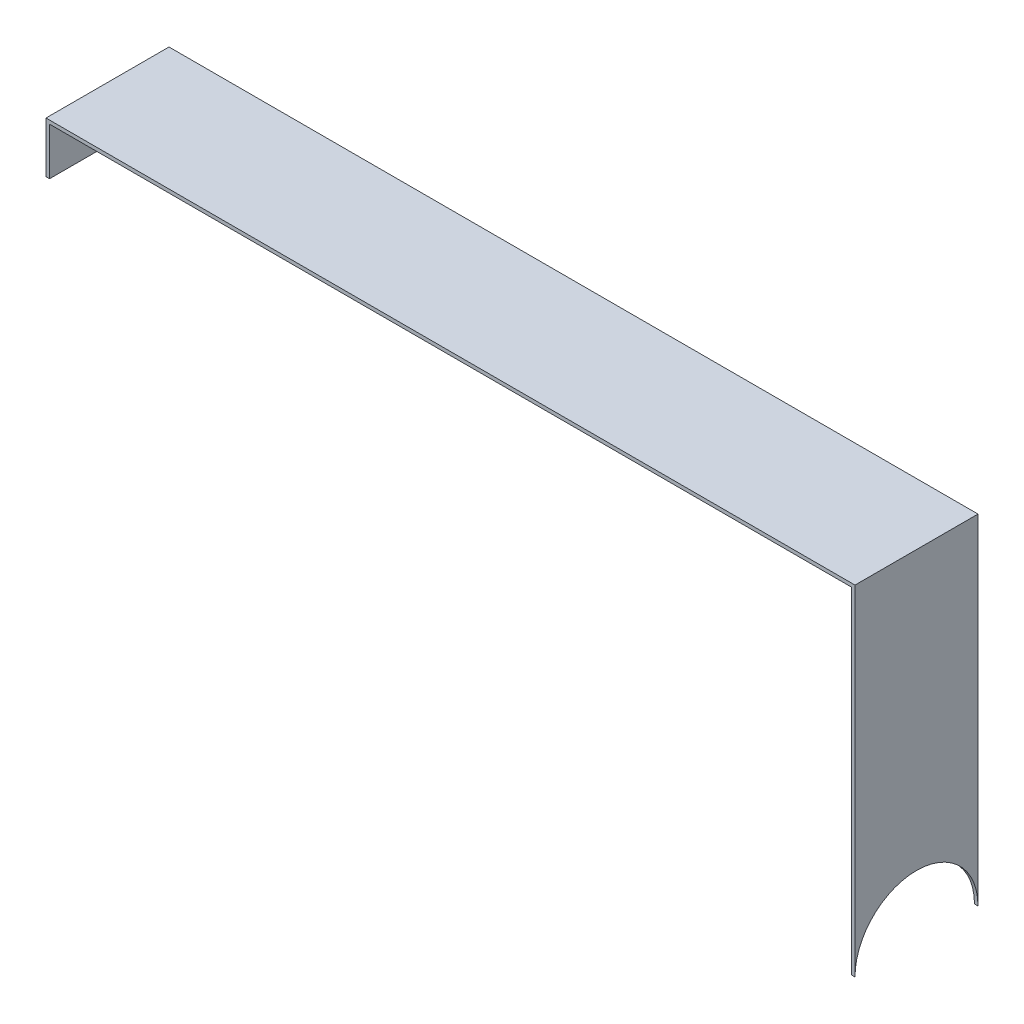
ISO-10303-21;
HEADER;
FILE_DESCRIPTION(('STEP AP214'),'2;1');
FILE_NAME('part.step','',(''),(''),'','','');
FILE_SCHEMA(('AUTOMOTIVE_DESIGN { 1 0 10303 214 1 1 1 1 }'));
ENDSEC;
DATA;
#1=APPLICATION_CONTEXT('core data for automotive mechanical design processes');
#2=APPLICATION_PROTOCOL_DEFINITION('international standard','automotive_design',2000,#1);
#3=PRODUCT_CONTEXT('',#1,'mechanical');
#4=PRODUCT('Part','Part','',(#3));
#5=PRODUCT_RELATED_PRODUCT_CATEGORY('part','',(#4));
#6=PRODUCT_DEFINITION_FORMATION('','',#4);
#7=PRODUCT_DEFINITION_CONTEXT('part definition',#1,'design');
#8=PRODUCT_DEFINITION('design','',#6,#7);
#9=PRODUCT_DEFINITION_SHAPE('','',#8);
#10=(LENGTH_UNIT() NAMED_UNIT(*) SI_UNIT(.MILLI.,.METRE.));
#11=(NAMED_UNIT(*) PLANE_ANGLE_UNIT() SI_UNIT($,.RADIAN.));
#12=(NAMED_UNIT(*) SI_UNIT($,.STERADIAN.) SOLID_ANGLE_UNIT());
#13=UNCERTAINTY_MEASURE_WITH_UNIT(LENGTH_MEASURE(1.E-05),#10,'distance_accuracy_value','');
#14=(GEOMETRIC_REPRESENTATION_CONTEXT(3) GLOBAL_UNCERTAINTY_ASSIGNED_CONTEXT((#13)) GLOBAL_UNIT_ASSIGNED_CONTEXT((#10,
#11,#12)) REPRESENTATION_CONTEXT('',''));
#15=CARTESIAN_POINT('',(0.,0.,0.));
#16=DIRECTION('',(0.,0.,1.));
#17=DIRECTION('',(1.,0.,0.));
#18=AXIS2_PLACEMENT_3D('',#15,#16,#17);
#19=CARTESIAN_POINT('',(206.15487364032,44.3470334548326,52.));
#20=DIRECTION('',(0.,1.,0.));
#21=DIRECTION('',(0.,0.,1.));
#22=AXIS2_PLACEMENT_3D('',#19,#20,#21);
#23=PLANE('',#22);
#24=DIRECTION('',(1.,0.,0.));
#25=VECTOR('',#24,1.);
#26=CARTESIAN_POINT('',(206.15487364032,44.3470334548326,0.));
#27=LINE('',#26,#25);
#28=CARTESIAN_POINT('',(-47.8451263596801,44.3470334548326,0.));
#29=VERTEX_POINT('',#28);
#30=CARTESIAN_POINT('',(291.15487364032,44.3470334548326,0.));
#31=VERTEX_POINT('',#30);
#32=EDGE_CURVE('E87',#29,#31,#27,.T.);
#33=ORIENTED_EDGE('',*,*,#32,.T.);
#34=DIRECTION('',(0.,0.,-1.));
#35=VECTOR('',#34,1.);
#36=CARTESIAN_POINT('',(291.15487364032,44.3470334548326,52.));
#37=LINE('',#36,#35);
#38=CARTESIAN_POINT('',(291.15487364032,44.3470334548326,52.));
#39=VERTEX_POINT('',#38);
#40=EDGE_CURVE('E11',#39,#31,#37,.T.);
#41=ORIENTED_EDGE('',*,*,#40,.F.);
#42=DIRECTION('',(1.,0.,0.));
#43=VECTOR('',#42,1.);
#44=CARTESIAN_POINT('',(-37.84512635968,44.3470334548326,52.));
#45=LINE('',#44,#43);
#46=CARTESIAN_POINT('',(-47.8451263596801,44.3470334548326,52.));
#47=VERTEX_POINT('',#46);
#48=EDGE_CURVE('E93',#47,#39,#45,.T.);
#49=ORIENTED_EDGE('',*,*,#48,.F.);
#50=DIRECTION('',(0.,0.,-1.));
#51=VECTOR('',#50,1.);
#52=CARTESIAN_POINT('',(-47.8451263596801,44.3470334548326,52.));
#53=LINE('',#52,#51);
#54=EDGE_CURVE('E124',#47,#29,#53,.T.);
#55=ORIENTED_EDGE('',*,*,#54,.T.);
#56=EDGE_LOOP('',(#33,#41,#49,#55));
#57=FACE_BOUND('',#56,.T.);
#58=ADVANCED_FACE('F37',(#57),#23,.F.);
#59=CARTESIAN_POINT('',(291.15487364032,44.3470334548326,52.));
#60=DIRECTION('',(1.,0.,0.));
#61=DIRECTION('',(0.,0.,-1.));
#62=AXIS2_PLACEMENT_3D('',#59,#60,#61);
#63=PLANE('',#62);
#64=DIRECTION('',(0.,-1.,0.));
#65=VECTOR('',#64,1.);
#66=CARTESIAN_POINT('',(291.15487364032,44.3470334548326,0.));
#67=LINE('',#66,#65);
#68=CARTESIAN_POINT('',(291.15487364032,-97.6529665451674,0.));
#69=VERTEX_POINT('',#68);
#70=EDGE_CURVE('E129',#31,#69,#67,.T.);
#71=ORIENTED_EDGE('',*,*,#70,.T.);
#72=CARTESIAN_POINT('',(291.15487364032,-97.6529665451674,26.));
#73=DIRECTION('',(-1.,0.,0.));
#74=DIRECTION('',(0.,0.,1.));
#75=AXIS2_PLACEMENT_3D('',#72,#73,#74);
#76=CIRCLE('',#75,26.);
#77=CARTESIAN_POINT('',(291.15487364032,-97.6529665451674,52.));
#78=VERTEX_POINT('',#77);
#79=EDGE_CURVE('E181',#78,#69,#76,.T.);
#80=ORIENTED_EDGE('',*,*,#79,.F.);
#81=DIRECTION('',(0.,-1.,0.));
#82=VECTOR('',#81,1.);
#83=CARTESIAN_POINT('',(291.15487364032,44.3470334548326,52.));
#84=LINE('',#83,#82);
#85=EDGE_CURVE('E162',#39,#78,#84,.T.);
#86=ORIENTED_EDGE('',*,*,#85,.F.);
#87=ORIENTED_EDGE('',*,*,#40,.T.);
#88=EDGE_LOOP('',(#71,#80,#86,#87));
#89=FACE_BOUND('',#88,.T.);
#90=ADVANCED_FACE('F183',(#89),#63,.F.);
#91=CARTESIAN_POINT('',(292.65487364032,-97.6529665451674,52.));
#92=DIRECTION('',(-1.,0.,0.));
#93=DIRECTION('',(0.,0.,1.));
#94=AXIS2_PLACEMENT_3D('',#91,#92,#93);
#95=PLANE('',#94);
#96=DIRECTION('',(0.,1.,0.));
#97=VECTOR('',#96,1.);
#98=CARTESIAN_POINT('',(292.65487364032,-97.6529665451674,52.));
#99=LINE('',#98,#97);
#100=CARTESIAN_POINT('',(292.65487364032,-97.6529665451674,52.));
#101=VERTEX_POINT('',#100);
#102=CARTESIAN_POINT('',(292.65487364032,45.8470334548325,52.));
#103=VERTEX_POINT('',#102);
#104=EDGE_CURVE('E171',#101,#103,#99,.T.);
#105=ORIENTED_EDGE('',*,*,#104,.F.);
#106=CARTESIAN_POINT('',(292.65487364032,-97.6529665451674,26.));
#107=DIRECTION('',(-1.,0.,0.));
#108=DIRECTION('',(0.,0.,1.));
#109=AXIS2_PLACEMENT_3D('',#106,#107,#108);
#110=CIRCLE('',#109,26.);
#111=CARTESIAN_POINT('',(292.65487364032,-97.6529665451674,0.));
#112=VERTEX_POINT('',#111);
#113=EDGE_CURVE('E130',#101,#112,#110,.T.);
#114=ORIENTED_EDGE('',*,*,#113,.T.);
#115=DIRECTION('',(0.,1.,0.));
#116=VECTOR('',#115,1.);
#117=CARTESIAN_POINT('',(292.65487364032,-97.6529665451674,0.));
#118=LINE('',#117,#116);
#119=CARTESIAN_POINT('',(292.65487364032,45.8470334548325,0.));
#120=VERTEX_POINT('',#119);
#121=EDGE_CURVE('E136',#112,#120,#118,.T.);
#122=ORIENTED_EDGE('',*,*,#121,.T.);
#123=DIRECTION('',(0.,0.,-1.));
#124=VECTOR('',#123,1.);
#125=CARTESIAN_POINT('',(292.65487364032,45.8470334548325,52.));
#126=LINE('',#125,#124);
#127=EDGE_CURVE('E45',#103,#120,#126,.T.);
#128=ORIENTED_EDGE('',*,*,#127,.F.);
#129=EDGE_LOOP('',(#105,#114,#122,#128));
#130=FACE_BOUND('',#129,.T.);
#131=ADVANCED_FACE('F174',(#130),#95,.F.);
#132=CARTESIAN_POINT('',(292.65487364032,45.8470334548325,52.));
#133=DIRECTION('',(0.,-1.,0.));
#134=DIRECTION('',(0.,0.,-1.));
#135=AXIS2_PLACEMENT_3D('',#132,#133,#134);
#136=PLANE('',#135);
#137=DIRECTION('',(-1.,0.,0.));
#138=VECTOR('',#137,1.);
#139=CARTESIAN_POINT('',(292.65487364032,45.8470334548325,0.));
#140=LINE('',#139,#138);
#141=CARTESIAN_POINT('',(-49.3451263596801,45.8470334548325,0.));
#142=VERTEX_POINT('',#141);
#143=EDGE_CURVE('E138',#120,#142,#140,.T.);
#144=ORIENTED_EDGE('',*,*,#143,.T.);
#145=DIRECTION('',(0.,0.,-1.));
#146=VECTOR('',#145,1.);
#147=CARTESIAN_POINT('',(-49.3451263596801,45.8470334548325,52.));
#148=LINE('',#147,#146);
#149=CARTESIAN_POINT('',(-49.3451263596801,45.8470334548325,52.));
#150=VERTEX_POINT('',#149);
#151=EDGE_CURVE('E119',#150,#142,#148,.T.);
#152=ORIENTED_EDGE('',*,*,#151,.F.);
#153=DIRECTION('',(-1.,0.,0.));
#154=VECTOR('',#153,1.);
#155=CARTESIAN_POINT('',(292.65487364032,45.8470334548325,52.));
#156=LINE('',#155,#154);
#157=EDGE_CURVE('E110',#103,#150,#156,.T.);
#158=ORIENTED_EDGE('',*,*,#157,.F.);
#159=ORIENTED_EDGE('',*,*,#127,.T.);
#160=EDGE_LOOP('',(#144,#152,#158,#159));
#161=FACE_BOUND('',#160,.T.);
#162=ADVANCED_FACE('F151',(#161),#136,.F.);
#163=CARTESIAN_POINT('',(-49.3451263596801,45.8470334548325,52.));
#164=DIRECTION('',(1.,0.,0.));
#165=DIRECTION('',(0.,0.,-1.));
#166=AXIS2_PLACEMENT_3D('',#163,#164,#165);
#167=PLANE('',#166);
#168=DIRECTION('',(0.,-1.,0.));
#169=VECTOR('',#168,1.);
#170=CARTESIAN_POINT('',(-49.3451263596801,45.8470334548325,0.));
#171=LINE('',#170,#169);
#172=CARTESIAN_POINT('',(-49.3451263596801,24.3470334548325,0.));
#173=VERTEX_POINT('',#172);
#174=EDGE_CURVE('E118',#142,#173,#171,.T.);
#175=ORIENTED_EDGE('',*,*,#174,.T.);
#176=DIRECTION('',(0.,0.,-1.));
#177=VECTOR('',#176,1.);
#178=CARTESIAN_POINT('',(-49.3451263596801,24.3470334548325,52.));
#179=LINE('',#178,#177);
#180=CARTESIAN_POINT('',(-49.3451263596801,24.3470334548325,52.));
#181=VERTEX_POINT('',#180);
#182=EDGE_CURVE('E115',#181,#173,#179,.T.);
#183=ORIENTED_EDGE('',*,*,#182,.F.);
#184=DIRECTION('',(0.,-1.,0.));
#185=VECTOR('',#184,1.);
#186=CARTESIAN_POINT('',(-49.3451263596801,45.8470334548325,52.));
#187=LINE('',#186,#185);
#188=EDGE_CURVE('E104',#150,#181,#187,.T.);
#189=ORIENTED_EDGE('',*,*,#188,.F.);
#190=ORIENTED_EDGE('',*,*,#151,.T.);
#191=EDGE_LOOP('',(#175,#183,#189,#190));
#192=FACE_BOUND('',#191,.T.);
#193=ADVANCED_FACE('F116',(#192),#167,.F.);
#194=CARTESIAN_POINT('',(-49.3451263596801,24.3470334548325,52.));
#195=DIRECTION('',(0.,1.,0.));
#196=DIRECTION('',(0.,0.,1.));
#197=AXIS2_PLACEMENT_3D('',#194,#195,#196);
#198=PLANE('',#197);
#199=DIRECTION('',(1.,0.,0.));
#200=VECTOR('',#199,1.);
#201=CARTESIAN_POINT('',(-49.3451263596801,24.3470334548325,0.));
#202=LINE('',#201,#200);
#203=CARTESIAN_POINT('',(-47.8451263596801,24.3470334548325,0.));
#204=VERTEX_POINT('',#203);
#205=EDGE_CURVE('E80',#173,#204,#202,.T.);
#206=ORIENTED_EDGE('',*,*,#205,.T.);
#207=DIRECTION('',(0.,0.,-1.));
#208=VECTOR('',#207,1.);
#209=CARTESIAN_POINT('',(-47.8451263596801,24.3470334548325,52.));
#210=LINE('',#209,#208);
#211=CARTESIAN_POINT('',(-47.8451263596801,24.3470334548325,52.));
#212=VERTEX_POINT('',#211);
#213=EDGE_CURVE('E120',#212,#204,#210,.T.);
#214=ORIENTED_EDGE('',*,*,#213,.F.);
#215=DIRECTION('',(1.,0.,0.));
#216=VECTOR('',#215,1.);
#217=CARTESIAN_POINT('',(-49.3451263596801,24.3470334548325,52.));
#218=LINE('',#217,#216);
#219=EDGE_CURVE('E108',#181,#212,#218,.T.);
#220=ORIENTED_EDGE('',*,*,#219,.F.);
#221=ORIENTED_EDGE('',*,*,#182,.T.);
#222=EDGE_LOOP('',(#206,#214,#220,#221));
#223=FACE_BOUND('',#222,.T.);
#224=ADVANCED_FACE('F122',(#223),#198,.F.);
#225=CARTESIAN_POINT('',(-47.8451263596801,44.3470334548326,52.));
#226=DIRECTION('',(-1.,0.,0.));
#227=DIRECTION('',(0.,0.,1.));
#228=AXIS2_PLACEMENT_3D('',#225,#226,#227);
#229=PLANE('',#228);
#230=DIRECTION('',(0.,1.,0.));
#231=VECTOR('',#230,1.);
#232=CARTESIAN_POINT('',(-47.8451263596801,44.3470334548326,0.));
#233=LINE('',#232,#231);
#234=EDGE_CURVE('E142',#204,#29,#233,.T.);
#235=ORIENTED_EDGE('',*,*,#234,.T.);
#236=ORIENTED_EDGE('',*,*,#54,.F.);
#237=DIRECTION('',(0.,1.,0.));
#238=VECTOR('',#237,1.);
#239=CARTESIAN_POINT('',(-47.8451263596801,44.3470334548326,52.));
#240=LINE('',#239,#238);
#241=EDGE_CURVE('E53',#212,#47,#240,.T.);
#242=ORIENTED_EDGE('',*,*,#241,.F.);
#243=ORIENTED_EDGE('',*,*,#213,.T.);
#244=EDGE_LOOP('',(#235,#236,#242,#243));
#245=FACE_BOUND('',#244,.T.);
#246=ADVANCED_FACE('F159',(#245),#229,.F.);
#247=CARTESIAN_POINT('',(0.,0.,52.));
#248=DIRECTION('',(0.,0.,1.));
#249=DIRECTION('',(1.,0.,0.));
#250=AXIS2_PLACEMENT_3D('',#247,#248,#249);
#251=PLANE('',#250);
#252=ORIENTED_EDGE('',*,*,#48,.T.);
#253=ORIENTED_EDGE('',*,*,#85,.T.);
#254=DIRECTION('',(1.,0.,0.));
#255=VECTOR('',#254,1.);
#256=CARTESIAN_POINT('',(291.15487364032,-97.6529665451674,52.));
#257=LINE('',#256,#255);
#258=EDGE_CURVE('E164',#78,#101,#257,.T.);
#259=ORIENTED_EDGE('',*,*,#258,.T.);
#260=ORIENTED_EDGE('',*,*,#104,.T.);
#261=ORIENTED_EDGE('',*,*,#157,.T.);
#262=ORIENTED_EDGE('',*,*,#188,.T.);
#263=ORIENTED_EDGE('',*,*,#219,.T.);
#264=ORIENTED_EDGE('',*,*,#241,.T.);
#265=EDGE_LOOP('',(#252,#253,#259,#260,#261,#262,#263,#264));
#266=FACE_BOUND('',#265,.T.);
#267=ADVANCED_FACE('F106',(#266),#251,.T.);
#268=CARTESIAN_POINT('',(0.,0.,0.));
#269=DIRECTION('',(0.,0.,1.));
#270=DIRECTION('',(1.,0.,0.));
#271=AXIS2_PLACEMENT_3D('',#268,#269,#270);
#272=PLANE('',#271);
#273=ORIENTED_EDGE('',*,*,#32,.F.);
#274=ORIENTED_EDGE('',*,*,#234,.F.);
#275=ORIENTED_EDGE('',*,*,#205,.F.);
#276=ORIENTED_EDGE('',*,*,#174,.F.);
#277=ORIENTED_EDGE('',*,*,#143,.F.);
#278=ORIENTED_EDGE('',*,*,#121,.F.);
#279=DIRECTION('',(1.,0.,0.));
#280=VECTOR('',#279,1.);
#281=CARTESIAN_POINT('',(291.15487364032,-97.6529665451674,0.));
#282=LINE('',#281,#280);
#283=EDGE_CURVE('E133',#69,#112,#282,.T.);
#284=ORIENTED_EDGE('',*,*,#283,.F.);
#285=ORIENTED_EDGE('',*,*,#70,.F.);
#286=EDGE_LOOP('',(#273,#274,#275,#276,#277,#278,#284,#285));
#287=FACE_BOUND('',#286,.T.);
#288=ADVANCED_FACE('F155',(#287),#272,.F.);
#289=CARTESIAN_POINT('',(343.15487364032,-97.6529665451674,26.));
#290=DIRECTION('',(-1.,0.,0.));
#291=DIRECTION('',(0.,0.,1.));
#292=AXIS2_PLACEMENT_3D('',#289,#290,#291);
#293=CYLINDRICAL_SURFACE('',#292,26.);
#294=ORIENTED_EDGE('',*,*,#79,.T.);
#295=ORIENTED_EDGE('',*,*,#283,.T.);
#296=ORIENTED_EDGE('',*,*,#113,.F.);
#297=ORIENTED_EDGE('',*,*,#258,.F.);
#298=EDGE_LOOP('',(#294,#295,#296,#297));
#299=FACE_BOUND('',#298,.T.);
#300=ADVANCED_FACE('F180',(#299),#293,.F.);
#301=CLOSED_SHELL('',(#58,#90,#131,#162,#193,#224,#246,#267,#288,#300));
#302=MANIFOLD_SOLID_BREP('B2',#301);
#303=ADVANCED_BREP_SHAPE_REPRESENTATION('',(#18,#302),#14);
#304=SHAPE_DEFINITION_REPRESENTATION(#9,#303);
ENDSEC;
END-ISO-10303-21;
